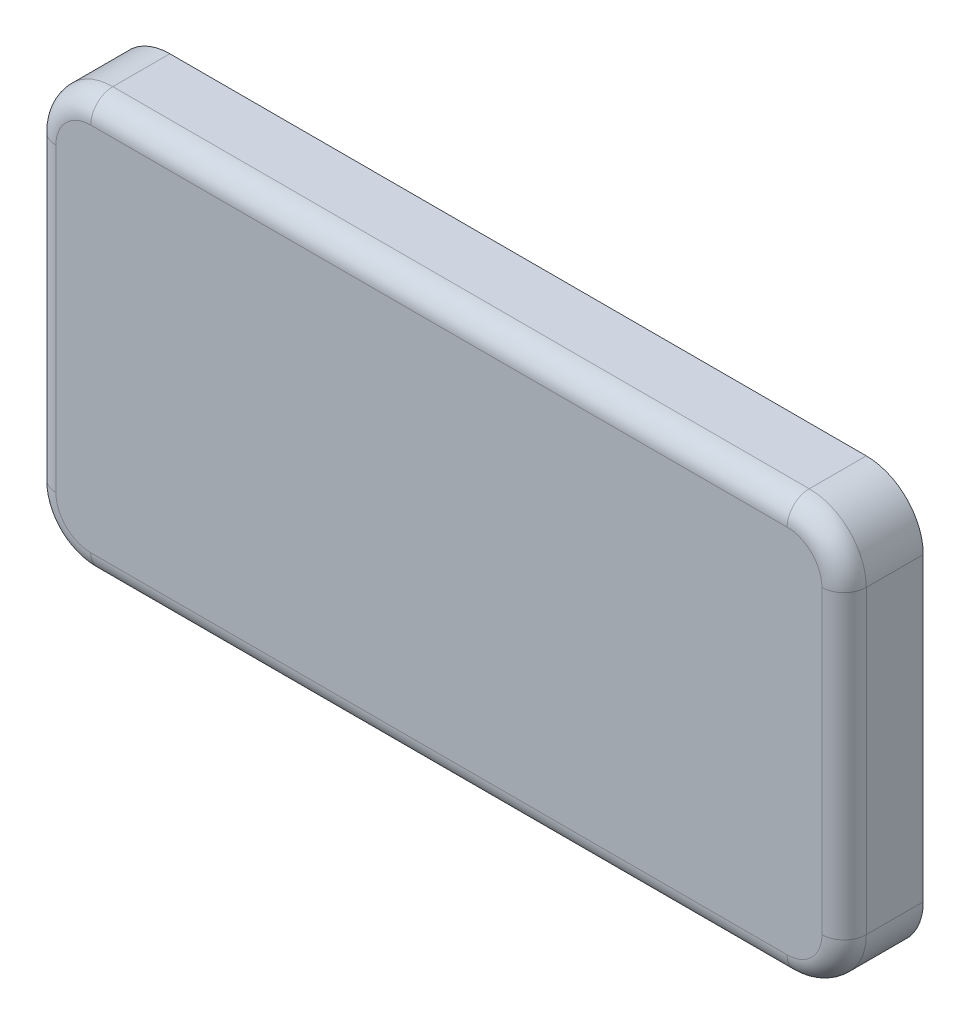
ISO-10303-21;
HEADER;
FILE_DESCRIPTION(('STEP AP214'),'2;1');
FILE_NAME('part.step','',(''),(''),'','','');
FILE_SCHEMA(('AUTOMOTIVE_DESIGN { 1 0 10303 214 1 1 1 1 }'));
ENDSEC;
DATA;
#1=APPLICATION_CONTEXT('core data for automotive mechanical design processes');
#2=APPLICATION_PROTOCOL_DEFINITION('international standard','automotive_design',2000,#1);
#3=PRODUCT_CONTEXT('',#1,'mechanical');
#4=PRODUCT('Part','Part','',(#3));
#5=PRODUCT_RELATED_PRODUCT_CATEGORY('part','',(#4));
#6=PRODUCT_DEFINITION_FORMATION('','',#4);
#7=PRODUCT_DEFINITION_CONTEXT('part definition',#1,'design');
#8=PRODUCT_DEFINITION('design','',#6,#7);
#9=PRODUCT_DEFINITION_SHAPE('','',#8);
#10=(LENGTH_UNIT() NAMED_UNIT(*) SI_UNIT(.MILLI.,.METRE.));
#11=(NAMED_UNIT(*) PLANE_ANGLE_UNIT() SI_UNIT($,.RADIAN.));
#12=(NAMED_UNIT(*) SI_UNIT($,.STERADIAN.) SOLID_ANGLE_UNIT());
#13=UNCERTAINTY_MEASURE_WITH_UNIT(LENGTH_MEASURE(1.E-05),#10,'distance_accuracy_value','');
#14=(GEOMETRIC_REPRESENTATION_CONTEXT(3) GLOBAL_UNCERTAINTY_ASSIGNED_CONTEXT((#13)) GLOBAL_UNIT_ASSIGNED_CONTEXT((#10,
#11,#12)) REPRESENTATION_CONTEXT('',''));
#15=CARTESIAN_POINT('',(0.,0.,0.));
#16=DIRECTION('',(0.,0.,1.));
#17=DIRECTION('',(1.,0.,0.));
#18=AXIS2_PLACEMENT_3D('',#15,#16,#17);
#19=CARTESIAN_POINT('',(0.,0.,0.));
#20=DIRECTION('',(0.,0.,1.));
#21=DIRECTION('',(1.,0.,0.));
#22=AXIS2_PLACEMENT_3D('',#19,#20,#21);
#23=PLANE('',#22);
#24=DIRECTION('',(1.,0.,0.));
#25=VECTOR('',#24,1.);
#26=CARTESIAN_POINT('',(0.,65.5,0.));
#27=LINE('',#26,#25);
#28=CARTESIAN_POINT('',(-110.,65.5,0.));
#29=VERTEX_POINT('',#28);
#30=CARTESIAN_POINT('',(110.,65.5,0.));
#31=VERTEX_POINT('',#30);
#32=EDGE_CURVE('E327',#29,#31,#27,.T.);
#33=ORIENTED_EDGE('',*,*,#32,.T.);
#34=CARTESIAN_POINT('',(110.,47.5,0.));
#35=DIRECTION('',(0.,0.,1.));
#36=DIRECTION('',(1.,0.,0.));
#37=AXIS2_PLACEMENT_3D('',#34,#35,#36);
#38=CIRCLE('',#37,18.);
#39=CARTESIAN_POINT('',(128.,47.5,0.));
#40=VERTEX_POINT('',#39);
#41=EDGE_CURVE('E355',#31,#40,#38,.F.);
#42=ORIENTED_EDGE('',*,*,#41,.T.);
#43=DIRECTION('',(0.,-1.,0.));
#44=VECTOR('',#43,1.);
#45=CARTESIAN_POINT('',(128.,0.,0.));
#46=LINE('',#45,#44);
#47=CARTESIAN_POINT('',(128.,-47.5,0.));
#48=VERTEX_POINT('',#47);
#49=EDGE_CURVE('E351',#40,#48,#46,.T.);
#50=ORIENTED_EDGE('',*,*,#49,.T.);
#51=CARTESIAN_POINT('',(110.,-47.5,0.));
#52=DIRECTION('',(0.,0.,1.));
#53=DIRECTION('',(1.,0.,0.));
#54=AXIS2_PLACEMENT_3D('',#51,#52,#53);
#55=CIRCLE('',#54,18.);
#56=CARTESIAN_POINT('',(110.,-65.5,0.));
#57=VERTEX_POINT('',#56);
#58=EDGE_CURVE('E347',#57,#48,#55,.T.);
#59=ORIENTED_EDGE('',*,*,#58,.F.);
#60=DIRECTION('',(1.,0.,0.));
#61=VECTOR('',#60,1.);
#62=CARTESIAN_POINT('',(0.,-65.5,0.));
#63=LINE('',#62,#61);
#64=CARTESIAN_POINT('',(-110.,-65.5,0.));
#65=VERTEX_POINT('',#64);
#66=EDGE_CURVE('E343',#65,#57,#63,.T.);
#67=ORIENTED_EDGE('',*,*,#66,.F.);
#68=CARTESIAN_POINT('',(-110.,-47.5,0.));
#69=DIRECTION('',(0.,0.,1.));
#70=DIRECTION('',(1.,0.,0.));
#71=AXIS2_PLACEMENT_3D('',#68,#69,#70);
#72=CIRCLE('',#71,17.9999999999999);
#73=CARTESIAN_POINT('',(-128.,-47.5,0.));
#74=VERTEX_POINT('',#73);
#75=EDGE_CURVE('E339',#74,#65,#72,.T.);
#76=ORIENTED_EDGE('',*,*,#75,.F.);
#77=DIRECTION('',(0.,-1.,0.));
#78=VECTOR('',#77,1.);
#79=CARTESIAN_POINT('',(-128.,0.,0.));
#80=LINE('',#79,#78);
#81=CARTESIAN_POINT('',(-128.,47.5,0.));
#82=VERTEX_POINT('',#81);
#83=EDGE_CURVE('E335',#82,#74,#80,.T.);
#84=ORIENTED_EDGE('',*,*,#83,.F.);
#85=CARTESIAN_POINT('',(-110.,47.5,0.));
#86=DIRECTION('',(0.,0.,1.));
#87=DIRECTION('',(1.,0.,0.));
#88=AXIS2_PLACEMENT_3D('',#85,#86,#87);
#89=CIRCLE('',#88,17.9999999999999);
#90=EDGE_CURVE('E331',#29,#82,#89,.T.);
#91=ORIENTED_EDGE('',*,*,#90,.F.);
#92=EDGE_LOOP('',(#33,#42,#50,#59,#67,#76,#84,#91));
#93=FACE_BOUND('',#92,.T.);
#94=DIRECTION('',(1.,0.,0.));
#95=VECTOR('',#94,1.);
#96=CARTESIAN_POINT('',(0.,62.5,0.));
#97=LINE('',#96,#95);
#98=CARTESIAN_POINT('',(-110.,62.4999999999999,0.));
#99=VERTEX_POINT('',#98);
#100=CARTESIAN_POINT('',(110.,62.5,0.));
#101=VERTEX_POINT('',#100);
#102=EDGE_CURVE('E222',#99,#101,#97,.T.);
#103=ORIENTED_EDGE('',*,*,#102,.F.);
#104=CARTESIAN_POINT('',(-110.,47.5,0.));
#105=DIRECTION('',(0.,0.,1.));
#106=DIRECTION('',(1.,0.,0.));
#107=AXIS2_PLACEMENT_3D('',#104,#105,#106);
#108=CIRCLE('',#107,14.9999999999999);
#109=CARTESIAN_POINT('',(-125.,47.5,0.));
#110=VERTEX_POINT('',#109);
#111=EDGE_CURVE('E303',#99,#110,#108,.T.);
#112=ORIENTED_EDGE('',*,*,#111,.T.);
#113=DIRECTION('',(0.,-1.,0.));
#114=VECTOR('',#113,1.);
#115=CARTESIAN_POINT('',(-125.,0.,0.));
#116=LINE('',#115,#114);
#117=CARTESIAN_POINT('',(-125.,-47.5,0.));
#118=VERTEX_POINT('',#117);
#119=EDGE_CURVE('E59',#110,#118,#116,.T.);
#120=ORIENTED_EDGE('',*,*,#119,.T.);
#121=CARTESIAN_POINT('',(-110.,-47.5,0.));
#122=DIRECTION('',(0.,0.,1.));
#123=DIRECTION('',(1.,0.,0.));
#124=AXIS2_PLACEMENT_3D('',#121,#122,#123);
#125=CIRCLE('',#124,14.9999999999999);
#126=CARTESIAN_POINT('',(-110.,-62.5,0.));
#127=VERTEX_POINT('',#126);
#128=EDGE_CURVE('E318',#118,#127,#125,.T.);
#129=ORIENTED_EDGE('',*,*,#128,.T.);
#130=DIRECTION('',(1.,0.,0.));
#131=VECTOR('',#130,1.);
#132=CARTESIAN_POINT('',(0.,-62.5,0.));
#133=LINE('',#132,#131);
#134=CARTESIAN_POINT('',(110.,-62.5,0.));
#135=VERTEX_POINT('',#134);
#136=EDGE_CURVE('E314',#127,#135,#133,.T.);
#137=ORIENTED_EDGE('',*,*,#136,.T.);
#138=CARTESIAN_POINT('',(110.,-47.5,0.));
#139=DIRECTION('',(0.,0.,1.));
#140=DIRECTION('',(1.,0.,0.));
#141=AXIS2_PLACEMENT_3D('',#138,#139,#140);
#142=CIRCLE('',#141,15.);
#143=CARTESIAN_POINT('',(125.,-47.5,0.));
#144=VERTEX_POINT('',#143);
#145=EDGE_CURVE('E310',#135,#144,#142,.T.);
#146=ORIENTED_EDGE('',*,*,#145,.T.);
#147=DIRECTION('',(0.,-1.,0.));
#148=VECTOR('',#147,1.);
#149=CARTESIAN_POINT('',(125.,0.,0.));
#150=LINE('',#149,#148);
#151=CARTESIAN_POINT('',(125.,47.5,0.));
#152=VERTEX_POINT('',#151);
#153=EDGE_CURVE('E306',#152,#144,#150,.T.);
#154=ORIENTED_EDGE('',*,*,#153,.F.);
#155=CARTESIAN_POINT('',(110.,47.5,0.));
#156=DIRECTION('',(0.,0.,1.));
#157=DIRECTION('',(1.,0.,0.));
#158=AXIS2_PLACEMENT_3D('',#155,#156,#157);
#159=CIRCLE('',#158,15.);
#160=EDGE_CURVE('E229',#101,#152,#159,.F.);
#161=ORIENTED_EDGE('',*,*,#160,.F.);
#162=EDGE_LOOP('',(#103,#112,#120,#129,#137,#146,#154,#161));
#163=FACE_BOUND('',#162,.T.);
#164=ADVANCED_FACE('F41',(#93,#163),#23,.F.);
#165=CARTESIAN_POINT('',(0.,65.5,25.));
#166=DIRECTION('',(0.,1.,0.));
#167=DIRECTION('',(0.,0.,1.));
#168=AXIS2_PLACEMENT_3D('',#165,#166,#167);
#169=PLANE('',#168);
#170=DIRECTION('',(0.,0.,-1.));
#171=VECTOR('',#170,1.);
#172=CARTESIAN_POINT('',(-110.,65.5,25.));
#173=LINE('',#172,#171);
#174=CARTESIAN_POINT('',(-110.,65.5,18.));
#175=VERTEX_POINT('',#174);
#176=EDGE_CURVE('E380',#175,#29,#173,.T.);
#177=ORIENTED_EDGE('',*,*,#176,.F.);
#178=DIRECTION('',(1.,0.,0.));
#179=VECTOR('',#178,1.);
#180=CARTESIAN_POINT('',(0.,65.5,18.));
#181=LINE('',#180,#179);
#182=CARTESIAN_POINT('',(110.,65.5,18.));
#183=VERTEX_POINT('',#182);
#184=EDGE_CURVE('E11',#175,#183,#181,.T.);
#185=ORIENTED_EDGE('',*,*,#184,.T.);
#186=DIRECTION('',(0.,0.,-1.));
#187=VECTOR('',#186,1.);
#188=CARTESIAN_POINT('',(110.,65.5,25.));
#189=LINE('',#188,#187);
#190=EDGE_CURVE('E359',#183,#31,#189,.T.);
#191=ORIENTED_EDGE('',*,*,#190,.T.);
#192=ORIENTED_EDGE('',*,*,#32,.F.);
#193=EDGE_LOOP('',(#177,#185,#191,#192));
#194=FACE_BOUND('',#193,.T.);
#195=ADVANCED_FACE('F482',(#194),#169,.T.);
#196=CARTESIAN_POINT('',(-110.,47.5,25.));
#197=DIRECTION('',(0.,0.,-1.));
#198=DIRECTION('',(-1.,0.,0.));
#199=AXIS2_PLACEMENT_3D('',#196,#197,#198);
#200=CYLINDRICAL_SURFACE('',#199,17.9999999999999);
#201=DIRECTION('',(0.,0.,-1.));
#202=VECTOR('',#201,1.);
#203=CARTESIAN_POINT('',(-128.,47.5,25.));
#204=LINE('',#203,#202);
#205=CARTESIAN_POINT('',(-128.,47.5,18.));
#206=VERTEX_POINT('',#205);
#207=EDGE_CURVE('E377',#206,#82,#204,.T.);
#208=ORIENTED_EDGE('',*,*,#207,.F.);
#209=CARTESIAN_POINT('',(-110.,47.5,18.));
#210=DIRECTION('',(0.,0.,1.));
#211=DIRECTION('',(1.,0.,0.));
#212=AXIS2_PLACEMENT_3D('',#209,#210,#211);
#213=CIRCLE('',#212,17.9999999999999);
#214=EDGE_CURVE('E51',#206,#175,#213,.F.);
#215=ORIENTED_EDGE('',*,*,#214,.T.);
#216=ORIENTED_EDGE('',*,*,#176,.T.);
#217=ORIENTED_EDGE('',*,*,#90,.T.);
#218=EDGE_LOOP('',(#208,#215,#216,#217));
#219=FACE_BOUND('',#218,.T.);
#220=ADVANCED_FACE('F495',(#219),#200,.T.);
#221=CARTESIAN_POINT('',(-128.,0.,25.));
#222=DIRECTION('',(1.,0.,0.));
#223=DIRECTION('',(0.,0.,-1.));
#224=AXIS2_PLACEMENT_3D('',#221,#222,#223);
#225=PLANE('',#224);
#226=DIRECTION('',(0.,0.,-1.));
#227=VECTOR('',#226,1.);
#228=CARTESIAN_POINT('',(-128.,-47.5,25.));
#229=LINE('',#228,#227);
#230=CARTESIAN_POINT('',(-128.,-47.5,18.));
#231=VERTEX_POINT('',#230);
#232=EDGE_CURVE('E374',#231,#74,#229,.T.);
#233=ORIENTED_EDGE('',*,*,#232,.F.);
#234=DIRECTION('',(0.,-1.,0.));
#235=VECTOR('',#234,1.);
#236=CARTESIAN_POINT('',(-128.,47.5,18.));
#237=LINE('',#236,#235);
#238=EDGE_CURVE('E424',#231,#206,#237,.F.);
#239=ORIENTED_EDGE('',*,*,#238,.T.);
#240=ORIENTED_EDGE('',*,*,#207,.T.);
#241=ORIENTED_EDGE('',*,*,#83,.T.);
#242=EDGE_LOOP('',(#233,#239,#240,#241));
#243=FACE_BOUND('',#242,.T.);
#244=ADVANCED_FACE('F498',(#243),#225,.F.);
#245=CARTESIAN_POINT('',(-110.,-47.5,25.));
#246=DIRECTION('',(0.,0.,-1.));
#247=DIRECTION('',(-1.,0.,0.));
#248=AXIS2_PLACEMENT_3D('',#245,#246,#247);
#249=CYLINDRICAL_SURFACE('',#248,17.9999999999999);
#250=DIRECTION('',(0.,0.,-1.));
#251=VECTOR('',#250,1.);
#252=CARTESIAN_POINT('',(-110.,-65.5,25.));
#253=LINE('',#252,#251);
#254=CARTESIAN_POINT('',(-110.,-65.5,18.));
#255=VERTEX_POINT('',#254);
#256=EDGE_CURVE('E371',#255,#65,#253,.T.);
#257=ORIENTED_EDGE('',*,*,#256,.F.);
#258=CARTESIAN_POINT('',(-110.,-47.5,18.));
#259=DIRECTION('',(0.,0.,1.));
#260=DIRECTION('',(1.,0.,0.));
#261=AXIS2_PLACEMENT_3D('',#258,#259,#260);
#262=CIRCLE('',#261,17.9999999999999);
#263=EDGE_CURVE('E421',#255,#231,#262,.F.);
#264=ORIENTED_EDGE('',*,*,#263,.T.);
#265=ORIENTED_EDGE('',*,*,#232,.T.);
#266=ORIENTED_EDGE('',*,*,#75,.T.);
#267=EDGE_LOOP('',(#257,#264,#265,#266));
#268=FACE_BOUND('',#267,.T.);
#269=ADVANCED_FACE('F501',(#268),#249,.T.);
#270=CARTESIAN_POINT('',(0.,-65.5,25.));
#271=DIRECTION('',(0.,1.,0.));
#272=DIRECTION('',(0.,0.,1.));
#273=AXIS2_PLACEMENT_3D('',#270,#271,#272);
#274=PLANE('',#273);
#275=DIRECTION('',(0.,0.,-1.));
#276=VECTOR('',#275,1.);
#277=CARTESIAN_POINT('',(110.,-65.5,25.));
#278=LINE('',#277,#276);
#279=CARTESIAN_POINT('',(110.,-65.5,18.));
#280=VERTEX_POINT('',#279);
#281=EDGE_CURVE('E368',#280,#57,#278,.T.);
#282=ORIENTED_EDGE('',*,*,#281,.F.);
#283=DIRECTION('',(1.,0.,0.));
#284=VECTOR('',#283,1.);
#285=CARTESIAN_POINT('',(-110.,-65.5,18.));
#286=LINE('',#285,#284);
#287=EDGE_CURVE('E418',#280,#255,#286,.F.);
#288=ORIENTED_EDGE('',*,*,#287,.T.);
#289=ORIENTED_EDGE('',*,*,#256,.T.);
#290=ORIENTED_EDGE('',*,*,#66,.T.);
#291=EDGE_LOOP('',(#282,#288,#289,#290));
#292=FACE_BOUND('',#291,.T.);
#293=ADVANCED_FACE('F505',(#292),#274,.F.);
#294=CARTESIAN_POINT('',(110.,-47.5,25.));
#295=DIRECTION('',(0.,0.,-1.));
#296=DIRECTION('',(-1.,0.,0.));
#297=AXIS2_PLACEMENT_3D('',#294,#295,#296);
#298=CYLINDRICAL_SURFACE('',#297,18.);
#299=DIRECTION('',(0.,0.,-1.));
#300=VECTOR('',#299,1.);
#301=CARTESIAN_POINT('',(128.,-47.5,25.));
#302=LINE('',#301,#300);
#303=CARTESIAN_POINT('',(128.,-47.5,18.));
#304=VERTEX_POINT('',#303);
#305=EDGE_CURVE('E365',#304,#48,#302,.T.);
#306=ORIENTED_EDGE('',*,*,#305,.F.);
#307=CARTESIAN_POINT('',(110.,-47.5,18.));
#308=DIRECTION('',(0.,0.,1.));
#309=DIRECTION('',(1.,0.,0.));
#310=AXIS2_PLACEMENT_3D('',#307,#308,#309);
#311=CIRCLE('',#310,18.);
#312=EDGE_CURVE('E415',#304,#280,#311,.F.);
#313=ORIENTED_EDGE('',*,*,#312,.T.);
#314=ORIENTED_EDGE('',*,*,#281,.T.);
#315=ORIENTED_EDGE('',*,*,#58,.T.);
#316=EDGE_LOOP('',(#306,#313,#314,#315));
#317=FACE_BOUND('',#316,.T.);
#318=ADVANCED_FACE('F524',(#317),#298,.T.);
#319=CARTESIAN_POINT('',(128.,0.,25.));
#320=DIRECTION('',(1.,0.,0.));
#321=DIRECTION('',(0.,0.,-1.));
#322=AXIS2_PLACEMENT_3D('',#319,#320,#321);
#323=PLANE('',#322);
#324=DIRECTION('',(0.,0.,-1.));
#325=VECTOR('',#324,1.);
#326=CARTESIAN_POINT('',(128.,47.5,25.));
#327=LINE('',#326,#325);
#328=CARTESIAN_POINT('',(128.,47.5,18.));
#329=VERTEX_POINT('',#328);
#330=EDGE_CURVE('E362',#329,#40,#327,.T.);
#331=ORIENTED_EDGE('',*,*,#330,.F.);
#332=DIRECTION('',(0.,-1.,0.));
#333=VECTOR('',#332,1.);
#334=CARTESIAN_POINT('',(128.,0.,18.));
#335=LINE('',#334,#333);
#336=EDGE_CURVE('E412',#329,#304,#335,.T.);
#337=ORIENTED_EDGE('',*,*,#336,.T.);
#338=ORIENTED_EDGE('',*,*,#305,.T.);
#339=ORIENTED_EDGE('',*,*,#49,.F.);
#340=EDGE_LOOP('',(#331,#337,#338,#339));
#341=FACE_BOUND('',#340,.T.);
#342=ADVANCED_FACE('F522',(#341),#323,.T.);
#343=CARTESIAN_POINT('',(110.,47.5,25.));
#344=DIRECTION('',(0.,0.,-1.));
#345=DIRECTION('',(-1.,0.,0.));
#346=AXIS2_PLACEMENT_3D('',#343,#344,#345);
#347=CYLINDRICAL_SURFACE('',#346,18.);
#348=ORIENTED_EDGE('',*,*,#190,.F.);
#349=CARTESIAN_POINT('',(110.,47.5,18.));
#350=DIRECTION('',(0.,0.,1.));
#351=DIRECTION('',(1.,0.,0.));
#352=AXIS2_PLACEMENT_3D('',#349,#350,#351);
#353=CIRCLE('',#352,18.);
#354=EDGE_CURVE('E383',#183,#329,#353,.F.);
#355=ORIENTED_EDGE('',*,*,#354,.T.);
#356=ORIENTED_EDGE('',*,*,#330,.T.);
#357=ORIENTED_EDGE('',*,*,#41,.F.);
#358=EDGE_LOOP('',(#348,#355,#356,#357));
#359=FACE_BOUND('',#358,.T.);
#360=ADVANCED_FACE('F486',(#359),#347,.T.);
#361=CARTESIAN_POINT('',(0.,0.,25.));
#362=DIRECTION('',(0.,0.,1.));
#363=DIRECTION('',(1.,0.,0.));
#364=AXIS2_PLACEMENT_3D('',#361,#362,#363);
#365=PLANE('',#364);
#366=DIRECTION('',(0.,-1.,0.));
#367=VECTOR('',#366,1.);
#368=CARTESIAN_POINT('',(121.,0.,25.));
#369=LINE('',#368,#367);
#370=CARTESIAN_POINT('',(121.,-47.5,25.));
#371=VERTEX_POINT('',#370);
#372=CARTESIAN_POINT('',(121.,47.5,25.));
#373=VERTEX_POINT('',#372);
#374=EDGE_CURVE('E405',#371,#373,#369,.F.);
#375=ORIENTED_EDGE('',*,*,#374,.T.);
#376=CARTESIAN_POINT('',(110.,47.5,25.));
#377=DIRECTION('',(0.,0.,1.));
#378=DIRECTION('',(1.,0.,0.));
#379=AXIS2_PLACEMENT_3D('',#376,#377,#378);
#380=CIRCLE('',#379,11.);
#381=CARTESIAN_POINT('',(110.,58.5,25.));
#382=VERTEX_POINT('',#381);
#383=EDGE_CURVE('E408',#373,#382,#380,.T.);
#384=ORIENTED_EDGE('',*,*,#383,.T.);
#385=DIRECTION('',(1.,0.,0.));
#386=VECTOR('',#385,1.);
#387=CARTESIAN_POINT('',(0.,58.5,25.));
#388=LINE('',#387,#386);
#389=CARTESIAN_POINT('',(-110.,58.5,25.));
#390=VERTEX_POINT('',#389);
#391=EDGE_CURVE('E387',#382,#390,#388,.F.);
#392=ORIENTED_EDGE('',*,*,#391,.T.);
#393=CARTESIAN_POINT('',(-110.,47.5,25.));
#394=DIRECTION('',(0.,0.,1.));
#395=DIRECTION('',(1.,0.,0.));
#396=AXIS2_PLACEMENT_3D('',#393,#394,#395);
#397=CIRCLE('',#396,10.9999999999999);
#398=CARTESIAN_POINT('',(-121.,47.5,25.));
#399=VERTEX_POINT('',#398);
#400=EDGE_CURVE('E390',#390,#399,#397,.T.);
#401=ORIENTED_EDGE('',*,*,#400,.T.);
#402=DIRECTION('',(0.,-1.,0.));
#403=VECTOR('',#402,1.);
#404=CARTESIAN_POINT('',(-121.,-47.5,25.));
#405=LINE('',#404,#403);
#406=CARTESIAN_POINT('',(-121.,-47.5,25.));
#407=VERTEX_POINT('',#406);
#408=EDGE_CURVE('E393',#399,#407,#405,.T.);
#409=ORIENTED_EDGE('',*,*,#408,.T.);
#410=CARTESIAN_POINT('',(-110.,-47.5,25.));
#411=DIRECTION('',(0.,0.,1.));
#412=DIRECTION('',(1.,0.,0.));
#413=AXIS2_PLACEMENT_3D('',#410,#411,#412);
#414=CIRCLE('',#413,10.9999999999999);
#415=CARTESIAN_POINT('',(-110.,-58.4999999999999,25.));
#416=VERTEX_POINT('',#415);
#417=EDGE_CURVE('E396',#407,#416,#414,.T.);
#418=ORIENTED_EDGE('',*,*,#417,.T.);
#419=DIRECTION('',(1.,0.,0.));
#420=VECTOR('',#419,1.);
#421=CARTESIAN_POINT('',(110.,-58.5,25.));
#422=LINE('',#421,#420);
#423=CARTESIAN_POINT('',(110.,-58.5,25.));
#424=VERTEX_POINT('',#423);
#425=EDGE_CURVE('E399',#416,#424,#422,.T.);
#426=ORIENTED_EDGE('',*,*,#425,.T.);
#427=CARTESIAN_POINT('',(110.,-47.5,25.));
#428=DIRECTION('',(0.,0.,1.));
#429=DIRECTION('',(1.,0.,0.));
#430=AXIS2_PLACEMENT_3D('',#427,#428,#429);
#431=CIRCLE('',#430,11.);
#432=EDGE_CURVE('E402',#424,#371,#431,.T.);
#433=ORIENTED_EDGE('',*,*,#432,.T.);
#434=EDGE_LOOP('',(#375,#384,#392,#401,#409,#418,#426,#433));
#435=FACE_BOUND('',#434,.T.);
#436=ADVANCED_FACE('F468',(#435),#365,.T.);
#437=CARTESIAN_POINT('',(-110.,-47.5,18.));
#438=DIRECTION('',(0.,0.,1.));
#439=DIRECTION('',(1.,0.,0.));
#440=AXIS2_PLACEMENT_3D('',#437,#438,#439);
#441=TOROIDAL_SURFACE('',#440,10.9999999999999,7.);
#442=CARTESIAN_POINT('',(-110.,-58.4999999999999,18.));
#443=DIRECTION('',(1.,0.,0.));
#444=DIRECTION('',(0.,0.,-1.));
#445=AXIS2_PLACEMENT_3D('',#442,#443,#444);
#446=CIRCLE('',#445,7.);
#447=EDGE_CURVE('E449',#416,#255,#446,.T.);
#448=ORIENTED_EDGE('',*,*,#447,.F.);
#449=ORIENTED_EDGE('',*,*,#417,.F.);
#450=CARTESIAN_POINT('',(-121.,-47.5,18.));
#451=DIRECTION('',(0.,1.,0.));
#452=DIRECTION('',(-1.,0.,0.));
#453=AXIS2_PLACEMENT_3D('',#450,#451,#452);
#454=CIRCLE('',#453,7.);
#455=EDGE_CURVE('E45',#231,#407,#454,.T.);
#456=ORIENTED_EDGE('',*,*,#455,.F.);
#457=ORIENTED_EDGE('',*,*,#263,.F.);
#458=EDGE_LOOP('',(#448,#449,#456,#457));
#459=FACE_BOUND('',#458,.T.);
#460=ADVANCED_FACE('F43',(#459),#441,.T.);
#461=CARTESIAN_POINT('',(-121.,0.,18.));
#462=DIRECTION('',(0.,1.,0.));
#463=DIRECTION('',(0.,0.,1.));
#464=AXIS2_PLACEMENT_3D('',#461,#462,#463);
#465=CYLINDRICAL_SURFACE('',#464,7.);
#466=ORIENTED_EDGE('',*,*,#455,.T.);
#467=ORIENTED_EDGE('',*,*,#408,.F.);
#468=CARTESIAN_POINT('',(-121.,47.5,18.));
#469=DIRECTION('',(0.,1.,0.));
#470=DIRECTION('',(0.,0.,1.));
#471=AXIS2_PLACEMENT_3D('',#468,#469,#470);
#472=CIRCLE('',#471,7.);
#473=EDGE_CURVE('E446',#206,#399,#472,.T.);
#474=ORIENTED_EDGE('',*,*,#473,.F.);
#475=ORIENTED_EDGE('',*,*,#238,.F.);
#476=EDGE_LOOP('',(#466,#467,#474,#475));
#477=FACE_BOUND('',#476,.T.);
#478=ADVANCED_FACE('F462',(#477),#465,.T.);
#479=CARTESIAN_POINT('',(0.,-58.5,18.));
#480=DIRECTION('',(-1.,0.,0.));
#481=DIRECTION('',(0.,0.,1.));
#482=AXIS2_PLACEMENT_3D('',#479,#480,#481);
#483=CYLINDRICAL_SURFACE('',#482,7.);
#484=ORIENTED_EDGE('',*,*,#447,.T.);
#485=ORIENTED_EDGE('',*,*,#287,.F.);
#486=CARTESIAN_POINT('',(110.,-58.5,18.));
#487=DIRECTION('',(1.,0.,0.));
#488=DIRECTION('',(0.,0.,-1.));
#489=AXIS2_PLACEMENT_3D('',#486,#487,#488);
#490=CIRCLE('',#489,7.);
#491=EDGE_CURVE('E442',#424,#280,#490,.T.);
#492=ORIENTED_EDGE('',*,*,#491,.F.);
#493=ORIENTED_EDGE('',*,*,#425,.F.);
#494=EDGE_LOOP('',(#484,#485,#492,#493));
#495=FACE_BOUND('',#494,.T.);
#496=ADVANCED_FACE('F506',(#495),#483,.T.);
#497=CARTESIAN_POINT('',(-110.,47.5,18.));
#498=DIRECTION('',(0.,0.,1.));
#499=DIRECTION('',(1.,0.,0.));
#500=AXIS2_PLACEMENT_3D('',#497,#498,#499);
#501=TOROIDAL_SURFACE('',#500,10.9999999999999,7.);
#502=ORIENTED_EDGE('',*,*,#473,.T.);
#503=ORIENTED_EDGE('',*,*,#400,.F.);
#504=CARTESIAN_POINT('',(-110.,58.4999999999999,18.));
#505=DIRECTION('',(1.,0.,0.));
#506=DIRECTION('',(0.,1.,0.));
#507=AXIS2_PLACEMENT_3D('',#504,#505,#506);
#508=CIRCLE('',#507,7.);
#509=EDGE_CURVE('E438',#175,#390,#508,.T.);
#510=ORIENTED_EDGE('',*,*,#509,.F.);
#511=ORIENTED_EDGE('',*,*,#214,.F.);
#512=EDGE_LOOP('',(#502,#503,#510,#511));
#513=FACE_BOUND('',#512,.T.);
#514=ADVANCED_FACE('F474',(#513),#501,.T.);
#515=CARTESIAN_POINT('',(110.,-47.5,18.));
#516=DIRECTION('',(0.,0.,1.));
#517=DIRECTION('',(1.,0.,0.));
#518=AXIS2_PLACEMENT_3D('',#515,#516,#517);
#519=TOROIDAL_SURFACE('',#518,11.,7.);
#520=ORIENTED_EDGE('',*,*,#491,.T.);
#521=ORIENTED_EDGE('',*,*,#312,.F.);
#522=CARTESIAN_POINT('',(121.,-47.5,18.));
#523=DIRECTION('',(0.,1.,0.));
#524=DIRECTION('',(0.,0.,1.));
#525=AXIS2_PLACEMENT_3D('',#522,#523,#524);
#526=CIRCLE('',#525,7.);
#527=EDGE_CURVE('E434',#371,#304,#526,.T.);
#528=ORIENTED_EDGE('',*,*,#527,.F.);
#529=ORIENTED_EDGE('',*,*,#432,.F.);
#530=EDGE_LOOP('',(#520,#521,#528,#529));
#531=FACE_BOUND('',#530,.T.);
#532=ADVANCED_FACE('F510',(#531),#519,.T.);
#533=CARTESIAN_POINT('',(0.,58.5,18.));
#534=DIRECTION('',(1.,0.,0.));
#535=DIRECTION('',(0.,0.,-1.));
#536=AXIS2_PLACEMENT_3D('',#533,#534,#535);
#537=CYLINDRICAL_SURFACE('',#536,7.);
#538=ORIENTED_EDGE('',*,*,#509,.T.);
#539=ORIENTED_EDGE('',*,*,#391,.F.);
#540=CARTESIAN_POINT('',(110.,58.5,18.));
#541=DIRECTION('',(1.,0.,0.));
#542=DIRECTION('',(0.,0.,-1.));
#543=AXIS2_PLACEMENT_3D('',#540,#541,#542);
#544=CIRCLE('',#543,7.);
#545=EDGE_CURVE('E431',#183,#382,#544,.T.);
#546=ORIENTED_EDGE('',*,*,#545,.F.);
#547=ORIENTED_EDGE('',*,*,#184,.F.);
#548=EDGE_LOOP('',(#538,#539,#546,#547));
#549=FACE_BOUND('',#548,.T.);
#550=ADVANCED_FACE('F477',(#549),#537,.T.);
#551=CARTESIAN_POINT('',(121.,0.,18.));
#552=DIRECTION('',(0.,-1.,0.));
#553=DIRECTION('',(0.,0.,-1.));
#554=AXIS2_PLACEMENT_3D('',#551,#552,#553);
#555=CYLINDRICAL_SURFACE('',#554,7.);
#556=ORIENTED_EDGE('',*,*,#527,.T.);
#557=ORIENTED_EDGE('',*,*,#336,.F.);
#558=CARTESIAN_POINT('',(121.,47.5,18.));
#559=DIRECTION('',(0.,1.,0.));
#560=DIRECTION('',(0.,0.,1.));
#561=AXIS2_PLACEMENT_3D('',#558,#559,#560);
#562=CIRCLE('',#561,7.);
#563=EDGE_CURVE('E215',#373,#329,#562,.T.);
#564=ORIENTED_EDGE('',*,*,#563,.F.);
#565=ORIENTED_EDGE('',*,*,#374,.F.);
#566=EDGE_LOOP('',(#556,#557,#564,#565));
#567=FACE_BOUND('',#566,.T.);
#568=ADVANCED_FACE('F519',(#567),#555,.T.);
#569=CARTESIAN_POINT('',(110.,47.5,18.));
#570=DIRECTION('',(0.,0.,1.));
#571=DIRECTION('',(1.,0.,0.));
#572=AXIS2_PLACEMENT_3D('',#569,#570,#571);
#573=TOROIDAL_SURFACE('',#572,11.,7.);
#574=ORIENTED_EDGE('',*,*,#545,.T.);
#575=ORIENTED_EDGE('',*,*,#383,.F.);
#576=ORIENTED_EDGE('',*,*,#563,.T.);
#577=ORIENTED_EDGE('',*,*,#354,.F.);
#578=EDGE_LOOP('',(#574,#575,#576,#577));
#579=FACE_BOUND('',#578,.T.);
#580=ADVANCED_FACE('F517',(#579),#573,.T.);
#581=CARTESIAN_POINT('',(0.,62.5,25.));
#582=DIRECTION('',(0.,1.,0.));
#583=DIRECTION('',(0.,0.,1.));
#584=AXIS2_PLACEMENT_3D('',#581,#582,#583);
#585=PLANE('',#584);
#586=DIRECTION('',(0.,0.,-1.));
#587=VECTOR('',#586,1.);
#588=CARTESIAN_POINT('',(-110.,62.4999999999999,25.));
#589=LINE('',#588,#587);
#590=CARTESIAN_POINT('',(-110.,62.4999999999999,18.));
#591=VERTEX_POINT('',#590);
#592=EDGE_CURVE('E247',#591,#99,#589,.T.);
#593=ORIENTED_EDGE('',*,*,#592,.T.);
#594=ORIENTED_EDGE('',*,*,#102,.T.);
#595=DIRECTION('',(0.,0.,1.));
#596=VECTOR('',#595,1.);
#597=CARTESIAN_POINT('',(110.,62.5,25.));
#598=LINE('',#597,#596);
#599=CARTESIAN_POINT('',(110.,62.5,18.));
#600=VERTEX_POINT('',#599);
#601=EDGE_CURVE('E219',#600,#101,#598,.F.);
#602=ORIENTED_EDGE('',*,*,#601,.F.);
#603=DIRECTION('',(1.,0.,0.));
#604=VECTOR('',#603,1.);
#605=CARTESIAN_POINT('',(0.,62.5,18.));
#606=LINE('',#605,#604);
#607=EDGE_CURVE('E205',#591,#600,#606,.T.);
#608=ORIENTED_EDGE('',*,*,#607,.F.);
#609=EDGE_LOOP('',(#593,#594,#602,#608));
#610=FACE_BOUND('',#609,.T.);
#611=ADVANCED_FACE('F220',(#610),#585,.F.);
#612=CARTESIAN_POINT('',(-110.,47.5,25.));
#613=DIRECTION('',(0.,0.,-1.));
#614=DIRECTION('',(-1.,0.,0.));
#615=AXIS2_PLACEMENT_3D('',#612,#613,#614);
#616=CYLINDRICAL_SURFACE('',#615,14.9999999999999);
#617=DIRECTION('',(0.,0.,-1.));
#618=VECTOR('',#617,1.);
#619=CARTESIAN_POINT('',(-125.,47.5,25.));
#620=LINE('',#619,#618);
#621=CARTESIAN_POINT('',(-125.,47.5,18.));
#622=VERTEX_POINT('',#621);
#623=EDGE_CURVE('E253',#622,#110,#620,.T.);
#624=ORIENTED_EDGE('',*,*,#623,.T.);
#625=ORIENTED_EDGE('',*,*,#111,.F.);
#626=ORIENTED_EDGE('',*,*,#592,.F.);
#627=CARTESIAN_POINT('',(-110.,47.5,18.));
#628=DIRECTION('',(0.,0.,-1.));
#629=DIRECTION('',(-1.,0.,0.));
#630=AXIS2_PLACEMENT_3D('',#627,#628,#629);
#631=CIRCLE('',#630,14.9999999999999);
#632=EDGE_CURVE('E216',#622,#591,#631,.T.);
#633=ORIENTED_EDGE('',*,*,#632,.F.);
#634=EDGE_LOOP('',(#624,#625,#626,#633));
#635=FACE_BOUND('',#634,.T.);
#636=ADVANCED_FACE('F655',(#635),#616,.F.);
#637=CARTESIAN_POINT('',(-125.,0.,25.));
#638=DIRECTION('',(1.,0.,0.));
#639=DIRECTION('',(0.,0.,-1.));
#640=AXIS2_PLACEMENT_3D('',#637,#638,#639);
#641=PLANE('',#640);
#642=DIRECTION('',(0.,0.,-1.));
#643=VECTOR('',#642,1.);
#644=CARTESIAN_POINT('',(-125.,-47.5,25.));
#645=LINE('',#644,#643);
#646=CARTESIAN_POINT('',(-125.,-47.5,18.));
#647=VERTEX_POINT('',#646);
#648=EDGE_CURVE('E840',#647,#118,#645,.T.);
#649=ORIENTED_EDGE('',*,*,#648,.T.);
#650=ORIENTED_EDGE('',*,*,#119,.F.);
#651=ORIENTED_EDGE('',*,*,#623,.F.);
#652=DIRECTION('',(0.,1.,0.));
#653=VECTOR('',#652,1.);
#654=CARTESIAN_POINT('',(-125.,0.,18.));
#655=LINE('',#654,#653);
#656=EDGE_CURVE('E844',#647,#622,#655,.T.);
#657=ORIENTED_EDGE('',*,*,#656,.F.);
#658=EDGE_LOOP('',(#649,#650,#651,#657));
#659=FACE_BOUND('',#658,.T.);
#660=ADVANCED_FACE('F664',(#659),#641,.T.);
#661=CARTESIAN_POINT('',(-110.,-47.5,25.));
#662=DIRECTION('',(0.,0.,-1.));
#663=DIRECTION('',(-1.,0.,0.));
#664=AXIS2_PLACEMENT_3D('',#661,#662,#663);
#665=CYLINDRICAL_SURFACE('',#664,14.9999999999999);
#666=DIRECTION('',(0.,0.,1.));
#667=VECTOR('',#666,1.);
#668=CARTESIAN_POINT('',(-110.,-62.5,25.));
#669=LINE('',#668,#667);
#670=CARTESIAN_POINT('',(-110.,-62.5,18.));
#671=VERTEX_POINT('',#670);
#672=EDGE_CURVE('E835',#671,#127,#669,.F.);
#673=ORIENTED_EDGE('',*,*,#672,.T.);
#674=ORIENTED_EDGE('',*,*,#128,.F.);
#675=ORIENTED_EDGE('',*,*,#648,.F.);
#676=CARTESIAN_POINT('',(-110.,-47.5,18.));
#677=DIRECTION('',(0.,0.,-1.));
#678=DIRECTION('',(-1.,0.,0.));
#679=AXIS2_PLACEMENT_3D('',#676,#677,#678);
#680=CIRCLE('',#679,14.9999999999999);
#681=EDGE_CURVE('E827',#671,#647,#680,.T.);
#682=ORIENTED_EDGE('',*,*,#681,.F.);
#683=EDGE_LOOP('',(#673,#674,#675,#682));
#684=FACE_BOUND('',#683,.T.);
#685=ADVANCED_FACE('F674',(#684),#665,.F.);
#686=CARTESIAN_POINT('',(0.,-62.5,25.));
#687=DIRECTION('',(0.,1.,0.));
#688=DIRECTION('',(0.,0.,1.));
#689=AXIS2_PLACEMENT_3D('',#686,#687,#688);
#690=PLANE('',#689);
#691=DIRECTION('',(0.,0.,-1.));
#692=VECTOR('',#691,1.);
#693=CARTESIAN_POINT('',(110.,-62.5,25.));
#694=LINE('',#693,#692);
#695=CARTESIAN_POINT('',(110.,-62.5,18.));
#696=VERTEX_POINT('',#695);
#697=EDGE_CURVE('E832',#696,#135,#694,.T.);
#698=ORIENTED_EDGE('',*,*,#697,.T.);
#699=ORIENTED_EDGE('',*,*,#136,.F.);
#700=ORIENTED_EDGE('',*,*,#672,.F.);
#701=DIRECTION('',(1.,0.,0.));
#702=VECTOR('',#701,1.);
#703=CARTESIAN_POINT('',(0.,-62.5,18.));
#704=LINE('',#703,#702);
#705=EDGE_CURVE('E822',#696,#671,#704,.F.);
#706=ORIENTED_EDGE('',*,*,#705,.F.);
#707=EDGE_LOOP('',(#698,#699,#700,#706));
#708=FACE_BOUND('',#707,.T.);
#709=ADVANCED_FACE('F683',(#708),#690,.T.);
#710=CARTESIAN_POINT('',(110.,-47.5,25.));
#711=DIRECTION('',(0.,0.,-1.));
#712=DIRECTION('',(-1.,0.,0.));
#713=AXIS2_PLACEMENT_3D('',#710,#711,#712);
#714=CYLINDRICAL_SURFACE('',#713,15.);
#715=DIRECTION('',(0.,0.,-1.));
#716=VECTOR('',#715,1.);
#717=CARTESIAN_POINT('',(125.,-47.5,25.));
#718=LINE('',#717,#716);
#719=CARTESIAN_POINT('',(125.,-47.5,18.));
#720=VERTEX_POINT('',#719);
#721=EDGE_CURVE('E817',#720,#144,#718,.T.);
#722=ORIENTED_EDGE('',*,*,#721,.T.);
#723=ORIENTED_EDGE('',*,*,#145,.F.);
#724=ORIENTED_EDGE('',*,*,#697,.F.);
#725=CARTESIAN_POINT('',(110.,-47.5,18.));
#726=DIRECTION('',(0.,0.,-1.));
#727=DIRECTION('',(-1.,0.,0.));
#728=AXIS2_PLACEMENT_3D('',#725,#726,#727);
#729=CIRCLE('',#728,15.);
#730=EDGE_CURVE('E820',#720,#696,#729,.T.);
#731=ORIENTED_EDGE('',*,*,#730,.F.);
#732=EDGE_LOOP('',(#722,#723,#724,#731));
#733=FACE_BOUND('',#732,.T.);
#734=ADVANCED_FACE('F693',(#733),#714,.F.);
#735=CARTESIAN_POINT('',(125.,0.,25.));
#736=DIRECTION('',(1.,0.,0.));
#737=DIRECTION('',(0.,0.,-1.));
#738=AXIS2_PLACEMENT_3D('',#735,#736,#737);
#739=PLANE('',#738);
#740=DIRECTION('',(0.,0.,-1.));
#741=VECTOR('',#740,1.);
#742=CARTESIAN_POINT('',(125.,47.5,25.));
#743=LINE('',#742,#741);
#744=CARTESIAN_POINT('',(125.,47.5,18.));
#745=VERTEX_POINT('',#744);
#746=EDGE_CURVE('E228',#745,#152,#743,.T.);
#747=ORIENTED_EDGE('',*,*,#746,.T.);
#748=ORIENTED_EDGE('',*,*,#153,.T.);
#749=ORIENTED_EDGE('',*,*,#721,.F.);
#750=DIRECTION('',(0.,1.,0.));
#751=VECTOR('',#750,1.);
#752=CARTESIAN_POINT('',(125.,0.,18.));
#753=LINE('',#752,#751);
#754=EDGE_CURVE('E257',#745,#720,#753,.F.);
#755=ORIENTED_EDGE('',*,*,#754,.F.);
#756=EDGE_LOOP('',(#747,#748,#749,#755));
#757=FACE_BOUND('',#756,.T.);
#758=ADVANCED_FACE('F703',(#757),#739,.F.);
#759=CARTESIAN_POINT('',(110.,47.5,25.));
#760=DIRECTION('',(0.,0.,-1.));
#761=DIRECTION('',(-1.,0.,0.));
#762=AXIS2_PLACEMENT_3D('',#759,#760,#761);
#763=CYLINDRICAL_SURFACE('',#762,15.);
#764=ORIENTED_EDGE('',*,*,#601,.T.);
#765=ORIENTED_EDGE('',*,*,#160,.T.);
#766=ORIENTED_EDGE('',*,*,#746,.F.);
#767=CARTESIAN_POINT('',(110.,47.5,18.));
#768=DIRECTION('',(0.,0.,-1.));
#769=DIRECTION('',(-1.,0.,0.));
#770=AXIS2_PLACEMENT_3D('',#767,#768,#769);
#771=CIRCLE('',#770,15.);
#772=EDGE_CURVE('E236',#600,#745,#771,.T.);
#773=ORIENTED_EDGE('',*,*,#772,.F.);
#774=EDGE_LOOP('',(#764,#765,#766,#773));
#775=FACE_BOUND('',#774,.T.);
#776=ADVANCED_FACE('F244',(#775),#763,.F.);
#777=CARTESIAN_POINT('',(0.,0.,22.));
#778=DIRECTION('',(0.,0.,1.));
#779=DIRECTION('',(1.,0.,0.));
#780=AXIS2_PLACEMENT_3D('',#777,#778,#779);
#781=PLANE('',#780);
#782=DIRECTION('',(0.,1.,0.));
#783=VECTOR('',#782,1.);
#784=CARTESIAN_POINT('',(121.,0.,22.));
#785=LINE('',#784,#783);
#786=CARTESIAN_POINT('',(121.,-47.5,22.));
#787=VERTEX_POINT('',#786);
#788=CARTESIAN_POINT('',(121.,47.5,22.));
#789=VERTEX_POINT('',#788);
#790=EDGE_CURVE('E262',#787,#789,#785,.T.);
#791=ORIENTED_EDGE('',*,*,#790,.F.);
#792=CARTESIAN_POINT('',(110.,-47.5,22.));
#793=DIRECTION('',(0.,0.,1.));
#794=DIRECTION('',(1.,0.,0.));
#795=AXIS2_PLACEMENT_3D('',#792,#793,#794);
#796=CIRCLE('',#795,11.);
#797=CARTESIAN_POINT('',(110.,-58.5,22.));
#798=VERTEX_POINT('',#797);
#799=EDGE_CURVE('E265',#798,#787,#796,.T.);
#800=ORIENTED_EDGE('',*,*,#799,.F.);
#801=DIRECTION('',(1.,0.,0.));
#802=VECTOR('',#801,1.);
#803=CARTESIAN_POINT('',(0.,-58.4999999999999,22.));
#804=LINE('',#803,#802);
#805=CARTESIAN_POINT('',(-110.,-58.4999999999999,22.));
#806=VERTEX_POINT('',#805);
#807=EDGE_CURVE('E276',#806,#798,#804,.T.);
#808=ORIENTED_EDGE('',*,*,#807,.F.);
#809=CARTESIAN_POINT('',(-110.,-47.5,22.));
#810=DIRECTION('',(0.,0.,1.));
#811=DIRECTION('',(1.,0.,0.));
#812=AXIS2_PLACEMENT_3D('',#809,#810,#811);
#813=CIRCLE('',#812,10.9999999999999);
#814=CARTESIAN_POINT('',(-121.,-47.5,22.));
#815=VERTEX_POINT('',#814);
#816=EDGE_CURVE('E273',#815,#806,#813,.T.);
#817=ORIENTED_EDGE('',*,*,#816,.F.);
#818=DIRECTION('',(0.,1.,0.));
#819=VECTOR('',#818,1.);
#820=CARTESIAN_POINT('',(-121.,0.,22.));
#821=LINE('',#820,#819);
#822=CARTESIAN_POINT('',(-121.,47.5,22.));
#823=VERTEX_POINT('',#822);
#824=EDGE_CURVE('E270',#823,#815,#821,.F.);
#825=ORIENTED_EDGE('',*,*,#824,.F.);
#826=CARTESIAN_POINT('',(-110.,47.5,22.));
#827=DIRECTION('',(0.,0.,1.));
#828=DIRECTION('',(1.,0.,0.));
#829=AXIS2_PLACEMENT_3D('',#826,#827,#828);
#830=CIRCLE('',#829,10.9999999999999);
#831=CARTESIAN_POINT('',(-110.,58.5,22.));
#832=VERTEX_POINT('',#831);
#833=EDGE_CURVE('E251',#832,#823,#830,.T.);
#834=ORIENTED_EDGE('',*,*,#833,.F.);
#835=DIRECTION('',(1.,0.,0.));
#836=VECTOR('',#835,1.);
#837=CARTESIAN_POINT('',(0.,58.5,22.));
#838=LINE('',#837,#836);
#839=CARTESIAN_POINT('',(110.,58.5,22.));
#840=VERTEX_POINT('',#839);
#841=EDGE_CURVE('E246',#840,#832,#838,.F.);
#842=ORIENTED_EDGE('',*,*,#841,.F.);
#843=CARTESIAN_POINT('',(110.,47.5,22.));
#844=DIRECTION('',(0.,0.,1.));
#845=DIRECTION('',(1.,0.,0.));
#846=AXIS2_PLACEMENT_3D('',#843,#844,#845);
#847=CIRCLE('',#846,11.);
#848=EDGE_CURVE('E239',#789,#840,#847,.T.);
#849=ORIENTED_EDGE('',*,*,#848,.F.);
#850=EDGE_LOOP('',(#791,#800,#808,#817,#825,#834,#842,#849));
#851=FACE_BOUND('',#850,.T.);
#852=ADVANCED_FACE('F722',(#851),#781,.F.);
#853=CARTESIAN_POINT('',(-110.,-47.5,18.));
#854=DIRECTION('',(0.,0.,1.));
#855=DIRECTION('',(1.,0.,0.));
#856=AXIS2_PLACEMENT_3D('',#853,#854,#855);
#857=TOROIDAL_SURFACE('',#856,10.9999999999999,4.);
#858=CARTESIAN_POINT('',(-110.,-58.5,18.));
#859=DIRECTION('',(-1.,0.,0.));
#860=DIRECTION('',(0.,0.,1.));
#861=AXIS2_PLACEMENT_3D('',#858,#859,#860);
#862=CIRCLE('',#861,4.);
#863=EDGE_CURVE('E281',#806,#671,#862,.F.);
#864=ORIENTED_EDGE('',*,*,#863,.T.);
#865=ORIENTED_EDGE('',*,*,#681,.T.);
#866=CARTESIAN_POINT('',(-121.,-47.5,18.));
#867=DIRECTION('',(0.,1.,0.));
#868=DIRECTION('',(0.,0.,1.));
#869=AXIS2_PLACEMENT_3D('',#866,#867,#868);
#870=CIRCLE('',#869,4.);
#871=EDGE_CURVE('E285',#647,#815,#870,.T.);
#872=ORIENTED_EDGE('',*,*,#871,.T.);
#873=ORIENTED_EDGE('',*,*,#816,.T.);
#874=EDGE_LOOP('',(#864,#865,#872,#873));
#875=FACE_BOUND('',#874,.T.);
#876=ADVANCED_FACE('F731',(#875),#857,.F.);
#877=CARTESIAN_POINT('',(-121.,0.,18.));
#878=DIRECTION('',(0.,1.,0.));
#879=DIRECTION('',(0.,0.,1.));
#880=AXIS2_PLACEMENT_3D('',#877,#878,#879);
#881=CYLINDRICAL_SURFACE('',#880,4.);
#882=ORIENTED_EDGE('',*,*,#871,.F.);
#883=ORIENTED_EDGE('',*,*,#656,.T.);
#884=CARTESIAN_POINT('',(-121.,47.5,18.));
#885=DIRECTION('',(0.,1.,0.));
#886=DIRECTION('',(-1.,0.,0.));
#887=AXIS2_PLACEMENT_3D('',#884,#885,#886);
#888=CIRCLE('',#887,4.);
#889=EDGE_CURVE('E286',#622,#823,#888,.T.);
#890=ORIENTED_EDGE('',*,*,#889,.T.);
#891=ORIENTED_EDGE('',*,*,#824,.T.);
#892=EDGE_LOOP('',(#882,#883,#890,#891));
#893=FACE_BOUND('',#892,.T.);
#894=ADVANCED_FACE('F741',(#893),#881,.F.);
#895=CARTESIAN_POINT('',(0.,-58.5,18.));
#896=DIRECTION('',(-1.,0.,0.));
#897=DIRECTION('',(0.,0.,1.));
#898=AXIS2_PLACEMENT_3D('',#895,#896,#897);
#899=CYLINDRICAL_SURFACE('',#898,4.);
#900=ORIENTED_EDGE('',*,*,#863,.F.);
#901=ORIENTED_EDGE('',*,*,#807,.T.);
#902=CARTESIAN_POINT('',(110.,-58.5,18.));
#903=DIRECTION('',(-1.,0.,0.));
#904=DIRECTION('',(0.,-1.,0.));
#905=AXIS2_PLACEMENT_3D('',#902,#903,#904);
#906=CIRCLE('',#905,4.);
#907=EDGE_CURVE('E260',#798,#696,#906,.F.);
#908=ORIENTED_EDGE('',*,*,#907,.T.);
#909=ORIENTED_EDGE('',*,*,#705,.T.);
#910=EDGE_LOOP('',(#900,#901,#908,#909));
#911=FACE_BOUND('',#910,.T.);
#912=ADVANCED_FACE('F751',(#911),#899,.F.);
#913=CARTESIAN_POINT('',(-110.,47.5,18.));
#914=DIRECTION('',(0.,0.,1.));
#915=DIRECTION('',(1.,0.,0.));
#916=AXIS2_PLACEMENT_3D('',#913,#914,#915);
#917=TOROIDAL_SURFACE('',#916,10.9999999999999,4.);
#918=ORIENTED_EDGE('',*,*,#889,.F.);
#919=ORIENTED_EDGE('',*,*,#632,.T.);
#920=CARTESIAN_POINT('',(-110.,58.5,18.));
#921=DIRECTION('',(1.,0.,0.));
#922=DIRECTION('',(0.,0.,-1.));
#923=AXIS2_PLACEMENT_3D('',#920,#921,#922);
#924=CIRCLE('',#923,4.);
#925=EDGE_CURVE('E212',#591,#832,#924,.T.);
#926=ORIENTED_EDGE('',*,*,#925,.T.);
#927=ORIENTED_EDGE('',*,*,#833,.T.);
#928=EDGE_LOOP('',(#918,#919,#926,#927));
#929=FACE_BOUND('',#928,.T.);
#930=ADVANCED_FACE('F761',(#929),#917,.F.);
#931=CARTESIAN_POINT('',(110.,-47.5,18.));
#932=DIRECTION('',(0.,0.,1.));
#933=DIRECTION('',(1.,0.,0.));
#934=AXIS2_PLACEMENT_3D('',#931,#932,#933);
#935=TOROIDAL_SURFACE('',#934,11.,4.);
#936=ORIENTED_EDGE('',*,*,#907,.F.);
#937=ORIENTED_EDGE('',*,*,#799,.T.);
#938=CARTESIAN_POINT('',(121.,-47.5,18.));
#939=DIRECTION('',(0.,-1.,0.));
#940=DIRECTION('',(0.,0.,-1.));
#941=AXIS2_PLACEMENT_3D('',#938,#939,#940);
#942=CIRCLE('',#941,4.);
#943=EDGE_CURVE('E241',#787,#720,#942,.F.);
#944=ORIENTED_EDGE('',*,*,#943,.T.);
#945=ORIENTED_EDGE('',*,*,#730,.T.);
#946=EDGE_LOOP('',(#936,#937,#944,#945));
#947=FACE_BOUND('',#946,.T.);
#948=ADVANCED_FACE('F771',(#947),#935,.F.);
#949=CARTESIAN_POINT('',(0.,58.5,18.));
#950=DIRECTION('',(1.,0.,0.));
#951=DIRECTION('',(0.,0.,-1.));
#952=AXIS2_PLACEMENT_3D('',#949,#950,#951);
#953=CYLINDRICAL_SURFACE('',#952,4.);
#954=ORIENTED_EDGE('',*,*,#925,.F.);
#955=ORIENTED_EDGE('',*,*,#607,.T.);
#956=CARTESIAN_POINT('',(110.,58.5,18.));
#957=DIRECTION('',(1.,0.,0.));
#958=DIRECTION('',(0.,1.,0.));
#959=AXIS2_PLACEMENT_3D('',#956,#957,#958);
#960=CIRCLE('',#959,4.);
#961=EDGE_CURVE('E209',#600,#840,#960,.T.);
#962=ORIENTED_EDGE('',*,*,#961,.T.);
#963=ORIENTED_EDGE('',*,*,#841,.T.);
#964=EDGE_LOOP('',(#954,#955,#962,#963));
#965=FACE_BOUND('',#964,.T.);
#966=ADVANCED_FACE('F207',(#965),#953,.F.);
#967=CARTESIAN_POINT('',(121.,0.,18.));
#968=DIRECTION('',(0.,-1.,0.));
#969=DIRECTION('',(0.,0.,-1.));
#970=AXIS2_PLACEMENT_3D('',#967,#968,#969);
#971=CYLINDRICAL_SURFACE('',#970,4.);
#972=ORIENTED_EDGE('',*,*,#943,.F.);
#973=ORIENTED_EDGE('',*,*,#790,.T.);
#974=CARTESIAN_POINT('',(121.,47.5,18.));
#975=DIRECTION('',(0.,-1.,0.));
#976=DIRECTION('',(1.,0.,0.));
#977=AXIS2_PLACEMENT_3D('',#974,#975,#976);
#978=CIRCLE('',#977,4.);
#979=EDGE_CURVE('E242',#789,#745,#978,.F.);
#980=ORIENTED_EDGE('',*,*,#979,.T.);
#981=ORIENTED_EDGE('',*,*,#754,.T.);
#982=EDGE_LOOP('',(#972,#973,#980,#981));
#983=FACE_BOUND('',#982,.T.);
#984=ADVANCED_FACE('F790',(#983),#971,.F.);
#985=CARTESIAN_POINT('',(110.,47.5,18.));
#986=DIRECTION('',(0.,0.,1.));
#987=DIRECTION('',(1.,0.,0.));
#988=AXIS2_PLACEMENT_3D('',#985,#986,#987);
#989=TOROIDAL_SURFACE('',#988,11.,4.);
#990=ORIENTED_EDGE('',*,*,#961,.F.);
#991=ORIENTED_EDGE('',*,*,#772,.T.);
#992=ORIENTED_EDGE('',*,*,#979,.F.);
#993=ORIENTED_EDGE('',*,*,#848,.T.);
#994=EDGE_LOOP('',(#990,#991,#992,#993));
#995=FACE_BOUND('',#994,.T.);
#996=ADVANCED_FACE('F234',(#995),#989,.F.);
#997=CLOSED_SHELL('',(#164,#195,#220,#244,#269,#293,#318,#342,#360,#436,#460,#478,#496,#514,
#532,#550,#568,#580,#611,#636,#660,#685,#709,#734,#758,#776,#852,#876,#894,#912,#930,#948,#966,
#984,#996));
#998=MANIFOLD_SOLID_BREP('B2',#997);
#999=ADVANCED_BREP_SHAPE_REPRESENTATION('',(#18,#998),#14);
#1000=SHAPE_DEFINITION_REPRESENTATION(#9,#999);
ENDSEC;
END-ISO-10303-21;
